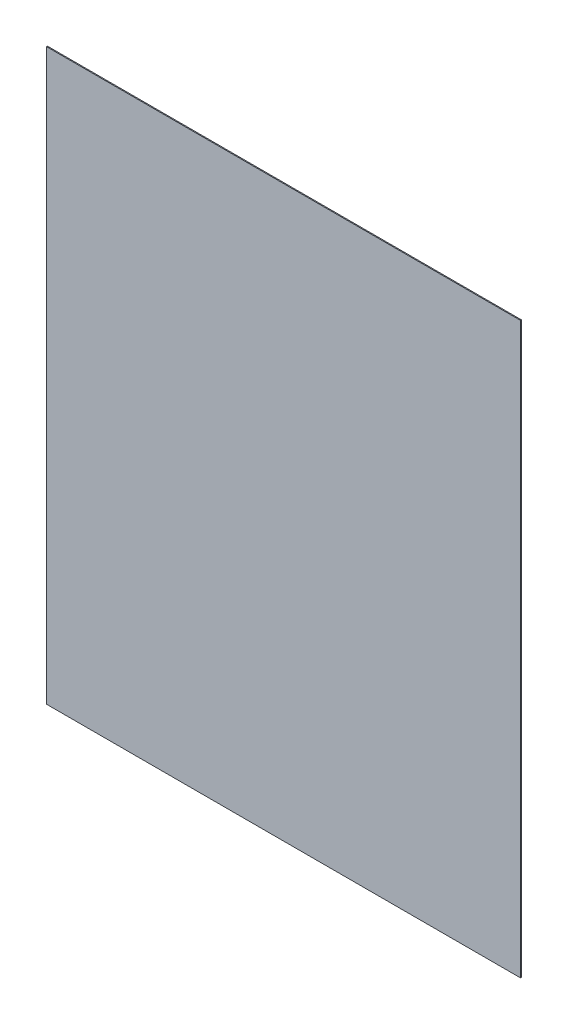
ISO-10303-21;
HEADER;
FILE_DESCRIPTION(('STEP AP214'),'2;1');
FILE_NAME('part.step','',(''),(''),'','','');
FILE_SCHEMA(('AUTOMOTIVE_DESIGN { 1 0 10303 214 1 1 1 1 }'));
ENDSEC;
DATA;
#1=APPLICATION_CONTEXT('core data for automotive mechanical design processes');
#2=APPLICATION_PROTOCOL_DEFINITION('international standard','automotive_design',2000,#1);
#3=PRODUCT_CONTEXT('',#1,'mechanical');
#4=PRODUCT('Part','Part','',(#3));
#5=PRODUCT_RELATED_PRODUCT_CATEGORY('part','',(#4));
#6=PRODUCT_DEFINITION_FORMATION('','',#4);
#7=PRODUCT_DEFINITION_CONTEXT('part definition',#1,'design');
#8=PRODUCT_DEFINITION('design','',#6,#7);
#9=PRODUCT_DEFINITION_SHAPE('','',#8);
#10=(LENGTH_UNIT() NAMED_UNIT(*) SI_UNIT(.MILLI.,.METRE.));
#11=(NAMED_UNIT(*) PLANE_ANGLE_UNIT() SI_UNIT($,.RADIAN.));
#12=(NAMED_UNIT(*) SI_UNIT($,.STERADIAN.) SOLID_ANGLE_UNIT());
#13=UNCERTAINTY_MEASURE_WITH_UNIT(LENGTH_MEASURE(1.E-05),#10,'distance_accuracy_value','');
#14=(GEOMETRIC_REPRESENTATION_CONTEXT(3) GLOBAL_UNCERTAINTY_ASSIGNED_CONTEXT((#13)) GLOBAL_UNIT_ASSIGNED_CONTEXT((#10,
#11,#12)) REPRESENTATION_CONTEXT('',''));
#15=CARTESIAN_POINT('',(0.,0.,0.));
#16=DIRECTION('',(0.,0.,1.));
#17=DIRECTION('',(1.,0.,0.));
#18=AXIS2_PLACEMENT_3D('',#15,#16,#17);
#19=CARTESIAN_POINT('',(-9.234225581534E-06,-2.031834392558E-05,0.00100076));
#20=DIRECTION('',(0.,0.,1.));
#21=DIRECTION('',(1.,0.,0.));
#22=AXIS2_PLACEMENT_3D('',#19,#20,#21);
#23=PLANE('',#22);
#24=DIRECTION('',(0.,1.,0.));
#25=VECTOR('',#24,1.);
#26=CARTESIAN_POINT('',(0.2493264,-0.299339,0.00100076));
#27=LINE('',#26,#25);
#28=CARTESIAN_POINT('',(0.2493264,-0.299339,0.00100076));
#29=VERTEX_POINT('',#28);
#30=CARTESIAN_POINT('',(0.2493264,0.29925772,0.00100076));
#31=VERTEX_POINT('',#30);
#32=EDGE_CURVE('E95',#29,#31,#27,.T.);
#33=ORIENTED_EDGE('',*,*,#32,.T.);
#34=DIRECTION('',(-0.999999986715633,0.00016299918284544,0.));
#35=VECTOR('',#34,1.);
#36=CARTESIAN_POINT('',(0.2493264,0.29925772,0.00100076));
#37=LINE('',#36,#35);
#38=CARTESIAN_POINT('',(-0.2493264,0.299339,0.00100076));
#39=VERTEX_POINT('',#38);
#40=EDGE_CURVE('E76',#31,#39,#37,.T.);
#41=ORIENTED_EDGE('',*,*,#40,.T.);
#42=DIRECTION('',(0.,-1.,0.));
#43=VECTOR('',#42,1.);
#44=CARTESIAN_POINT('',(-0.2493264,0.299339,0.00100076));
#45=LINE('',#44,#43);
#46=CARTESIAN_POINT('',(-0.2493264,-0.299339,0.00100076));
#47=VERTEX_POINT('',#46);
#48=EDGE_CURVE('E81',#39,#47,#45,.T.);
#49=ORIENTED_EDGE('',*,*,#48,.T.);
#50=DIRECTION('',(1.,0.,0.));
#51=VECTOR('',#50,1.);
#52=CARTESIAN_POINT('',(-0.2493264,-0.299339,0.00100076));
#53=LINE('',#52,#51);
#54=EDGE_CURVE('E11',#47,#29,#53,.T.);
#55=ORIENTED_EDGE('',*,*,#54,.T.);
#56=EDGE_LOOP('',(#33,#41,#49,#55));
#57=FACE_BOUND('',#56,.T.);
#58=ADVANCED_FACE('F17',(#57),#23,.T.);
#59=CARTESIAN_POINT('',(-9.234225581534E-06,-2.031834392558E-05,0.));
#60=DIRECTION('',(0.,0.,1.));
#61=DIRECTION('',(1.,0.,0.));
#62=AXIS2_PLACEMENT_3D('',#59,#60,#61);
#63=PLANE('',#62);
#64=DIRECTION('',(1.,0.,0.));
#65=VECTOR('',#64,1.);
#66=CARTESIAN_POINT('',(-0.2493264,-0.299339,0.));
#67=LINE('',#66,#65);
#68=CARTESIAN_POINT('',(-0.2493264,-0.299339,0.));
#69=VERTEX_POINT('',#68);
#70=CARTESIAN_POINT('',(0.2493264,-0.299339,0.));
#71=VERTEX_POINT('',#70);
#72=EDGE_CURVE('E21',#69,#71,#67,.T.);
#73=ORIENTED_EDGE('',*,*,#72,.F.);
#74=DIRECTION('',(0.,-1.,0.));
#75=VECTOR('',#74,1.);
#76=CARTESIAN_POINT('',(-0.2493264,0.299339,0.));
#77=LINE('',#76,#75);
#78=CARTESIAN_POINT('',(-0.2493264,0.299339,0.));
#79=VERTEX_POINT('',#78);
#80=EDGE_CURVE('E67',#79,#69,#77,.T.);
#81=ORIENTED_EDGE('',*,*,#80,.F.);
#82=DIRECTION('',(-0.999999986715633,0.00016299918284544,0.));
#83=VECTOR('',#82,1.);
#84=CARTESIAN_POINT('',(0.2493264,0.29925772,0.));
#85=LINE('',#84,#83);
#86=CARTESIAN_POINT('',(0.2493264,0.29925772,0.));
#87=VERTEX_POINT('',#86);
#88=EDGE_CURVE('E70',#87,#79,#85,.T.);
#89=ORIENTED_EDGE('',*,*,#88,.F.);
#90=DIRECTION('',(0.,1.,0.));
#91=VECTOR('',#90,1.);
#92=CARTESIAN_POINT('',(0.2493264,-0.299339,0.));
#93=LINE('',#92,#91);
#94=EDGE_CURVE('E111',#71,#87,#93,.T.);
#95=ORIENTED_EDGE('',*,*,#94,.F.);
#96=EDGE_LOOP('',(#73,#81,#89,#95));
#97=FACE_BOUND('',#96,.T.);
#98=ADVANCED_FACE('F19',(#97),#63,.F.);
#99=CARTESIAN_POINT('',(-0.2493264,-0.299339,0.));
#100=DIRECTION('',(0.,1.,0.));
#101=DIRECTION('',(1.,0.,0.));
#102=AXIS2_PLACEMENT_3D('',#99,#100,#101);
#103=PLANE('',#102);
#104=ORIENTED_EDGE('',*,*,#72,.T.);
#105=DIRECTION('',(0.,0.,1.));
#106=VECTOR('',#105,1.);
#107=CARTESIAN_POINT('',(0.2493264,-0.299339,0.));
#108=LINE('',#107,#106);
#109=EDGE_CURVE('E91',#71,#29,#108,.T.);
#110=ORIENTED_EDGE('',*,*,#109,.T.);
#111=ORIENTED_EDGE('',*,*,#54,.F.);
#112=DIRECTION('',(0.,0.,1.));
#113=VECTOR('',#112,1.);
#114=CARTESIAN_POINT('',(-0.2493264,-0.299339,0.));
#115=LINE('',#114,#113);
#116=EDGE_CURVE('E75',#69,#47,#115,.T.);
#117=ORIENTED_EDGE('',*,*,#116,.F.);
#118=EDGE_LOOP('',(#104,#110,#111,#117));
#119=FACE_BOUND('',#118,.T.);
#120=ADVANCED_FACE('F107',(#119),#103,.F.);
#121=CARTESIAN_POINT('',(-0.2493264,0.299339,0.));
#122=DIRECTION('',(1.,0.,0.));
#123=DIRECTION('',(0.,1.,0.));
#124=AXIS2_PLACEMENT_3D('',#121,#122,#123);
#125=PLANE('',#124);
#126=ORIENTED_EDGE('',*,*,#80,.T.);
#127=ORIENTED_EDGE('',*,*,#116,.T.);
#128=ORIENTED_EDGE('',*,*,#48,.F.);
#129=DIRECTION('',(0.,0.,1.));
#130=VECTOR('',#129,1.);
#131=CARTESIAN_POINT('',(-0.2493264,0.299339,0.));
#132=LINE('',#131,#130);
#133=EDGE_CURVE('E79',#79,#39,#132,.T.);
#134=ORIENTED_EDGE('',*,*,#133,.F.);
#135=EDGE_LOOP('',(#126,#127,#128,#134));
#136=FACE_BOUND('',#135,.T.);
#137=ADVANCED_FACE('F80',(#136),#125,.F.);
#138=CARTESIAN_POINT('',(0.2493264,0.29925772,0.));
#139=DIRECTION('',(-0.00016299918284544,-0.999999986715633,0.));
#140=DIRECTION('',(-0.999999986715633,0.00016299918284544,0.));
#141=AXIS2_PLACEMENT_3D('',#138,#139,#140);
#142=PLANE('',#141);
#143=ORIENTED_EDGE('',*,*,#88,.T.);
#144=ORIENTED_EDGE('',*,*,#133,.T.);
#145=ORIENTED_EDGE('',*,*,#40,.F.);
#146=DIRECTION('',(0.,0.,1.));
#147=VECTOR('',#146,1.);
#148=CARTESIAN_POINT('',(0.2493264,0.29925772,0.));
#149=LINE('',#148,#147);
#150=EDGE_CURVE('E88',#87,#31,#149,.T.);
#151=ORIENTED_EDGE('',*,*,#150,.F.);
#152=EDGE_LOOP('',(#143,#144,#145,#151));
#153=FACE_BOUND('',#152,.T.);
#154=ADVANCED_FACE('F86',(#153),#142,.F.);
#155=CARTESIAN_POINT('',(0.2493264,-0.299339,0.));
#156=DIRECTION('',(-1.,0.,0.));
#157=DIRECTION('',(0.,0.,1.));
#158=AXIS2_PLACEMENT_3D('',#155,#156,#157);
#159=PLANE('',#158);
#160=ORIENTED_EDGE('',*,*,#94,.T.);
#161=ORIENTED_EDGE('',*,*,#150,.T.);
#162=ORIENTED_EDGE('',*,*,#32,.F.);
#163=ORIENTED_EDGE('',*,*,#109,.F.);
#164=EDGE_LOOP('',(#160,#161,#162,#163));
#165=FACE_BOUND('',#164,.T.);
#166=ADVANCED_FACE('F110',(#165),#159,.F.);
#167=CLOSED_SHELL('',(#58,#98,#120,#137,#154,#166));
#168=MANIFOLD_SOLID_BREP('B1',#167);
#169=ADVANCED_BREP_SHAPE_REPRESENTATION('',(#18,#168),#14);
#170=SHAPE_DEFINITION_REPRESENTATION(#9,#169);
ENDSEC;
END-ISO-10303-21;
